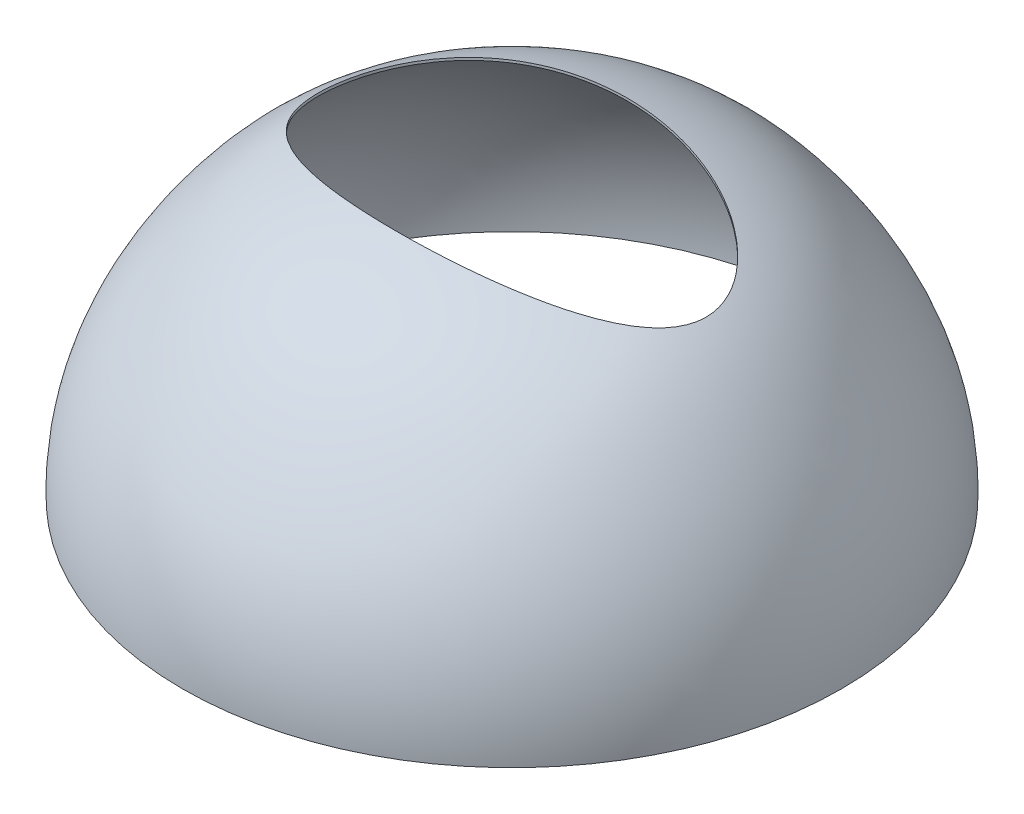
ISO-10303-21;
HEADER;
FILE_DESCRIPTION(('STEP AP214'),'2;1');
FILE_NAME('part.step','',(''),(''),'','','');
FILE_SCHEMA(('AUTOMOTIVE_DESIGN { 1 0 10303 214 1 1 1 1 }'));
ENDSEC;
DATA;
#1=APPLICATION_CONTEXT('core data for automotive mechanical design processes');
#2=APPLICATION_PROTOCOL_DEFINITION('international standard','automotive_design',2000,#1);
#3=PRODUCT_CONTEXT('',#1,'mechanical');
#4=PRODUCT('Part','Part','',(#3));
#5=PRODUCT_RELATED_PRODUCT_CATEGORY('part','',(#4));
#6=PRODUCT_DEFINITION_FORMATION('','',#4);
#7=PRODUCT_DEFINITION_CONTEXT('part definition',#1,'design');
#8=PRODUCT_DEFINITION('design','',#6,#7);
#9=PRODUCT_DEFINITION_SHAPE('','',#8);
#10=(LENGTH_UNIT() NAMED_UNIT(*) SI_UNIT(.MILLI.,.METRE.));
#11=(NAMED_UNIT(*) PLANE_ANGLE_UNIT() SI_UNIT($,.RADIAN.));
#12=(NAMED_UNIT(*) SI_UNIT($,.STERADIAN.) SOLID_ANGLE_UNIT());
#13=UNCERTAINTY_MEASURE_WITH_UNIT(LENGTH_MEASURE(1.E-05),#10,'distance_accuracy_value','');
#14=(GEOMETRIC_REPRESENTATION_CONTEXT(3) GLOBAL_UNCERTAINTY_ASSIGNED_CONTEXT((#13)) GLOBAL_UNIT_ASSIGNED_CONTEXT((#10,
#11,#12)) REPRESENTATION_CONTEXT('',''));
#15=CARTESIAN_POINT('',(0.,0.,0.));
#16=DIRECTION('',(0.,0.,1.));
#17=DIRECTION('',(1.,0.,0.));
#18=AXIS2_PLACEMENT_3D('',#15,#16,#17);
#19=CARTESIAN_POINT('',(29.8868118719822,127.,0.));
#20=CARTESIAN_POINT('',(44.4329937192612,123.661749797372,0.));
#21=CARTESIAN_POINT('',(59.4600695965972,119.177364974383,0.));
#22=CARTESIAN_POINT('',(76.3802162825854,110.552780869151,0.));
#23=CARTESIAN_POINT('',(79.6711653986904,108.677112641996,0.));
#24=CARTESIAN_POINT('',(84.422549965413,105.608187262072,0.));
#25=CARTESIAN_POINT('',(85.9755118883935,104.542641875036,0.));
#26=CARTESIAN_POINT('',(89.0122960555895,102.321504935741,0.));
#27=CARTESIAN_POINT('',(90.4951707596923,101.165037474816,0.));
#28=CARTESIAN_POINT('',(97.7393856845095,95.1560315878875,0.));
#29=CARTESIAN_POINT('',(102.992721730063,89.6397027291977,0.));
#30=CARTESIAN_POINT('',(109.009496987695,82.2474176647865,0.));
#31=CARTESIAN_POINT('',(110.185400974135,80.7441028935997,0.));
#32=CARTESIAN_POINT('',(112.485234630238,77.6979000253078,0.));
#33=CARTESIAN_POINT('',(113.608562564087,76.1554974018456,0.));
#34=CARTESIAN_POINT('',(116.89329072223,71.4725221185557,0.));
#35=CARTESIAN_POINT('',(118.969431325965,68.2761832175255,0.));
#36=CARTESIAN_POINT('',(124.813040843106,58.481166274015,0.));
#37=CARTESIAN_POINT('',(128.195628136789,51.6765538497008,0.));
#38=CARTESIAN_POINT('',(136.456109379892,30.5740358809839,0.));
#39=CARTESIAN_POINT('',(139.447346625365,15.5902478947314,0.));
#40=CARTESIAN_POINT('',(139.000412177218,0.028708614482394,0.));
#41=B_SPLINE_CURVE_WITH_KNOTS('',3,(#19,#20,#21,#22,#23,#24,#25,#26,#27,#28,#29,#30,#31,#32,#33,
#34,#35,#36,#37,#38,#39,#40),.UNSPECIFIED.,.F.,.F.,(4,2,2,2,2,2,2,2,2,2,4),(0.,0.25,0.3125,
0.34375,0.375,0.5,0.53125,0.5625,0.625,0.75,1.),.UNSPECIFIED.);
#42=CARTESIAN_POINT('',(0.,0.,0.));
#43=DIRECTION('',(0.,-1.,0.));
#44=AXIS1_PLACEMENT('',#42,#43);
#45=SURFACE_OF_REVOLUTION('',#41,#44);
#46=CARTESIAN_POINT('',(0.,0.028708614482394,0.));
#47=DIRECTION('',(0.,-1.,0.));
#48=DIRECTION('',(0.,0.,-1.));
#49=AXIS2_PLACEMENT_3D('',#46,#47,#48);
#50=CIRCLE('',#49,139.000412177218);
#51=CARTESIAN_POINT('',(0.,0.028708614482394,-139.000412177218));
#52=VERTEX_POINT('',#51);
#53=EDGE_CURVE('E10',#52,#52,#50,.T.);
#54=ORIENTED_EDGE('',*,*,#53,.T.);
#55=EDGE_LOOP('',(#54));
#56=FACE_BOUND('',#55,.T.);
#57=CARTESIAN_POINT('',(82.4558676308737,106.877258838717,0.));
#58=CARTESIAN_POINT('',(82.4558709742533,106.877256926171,-0.55983278321701));
#59=CARTESIAN_POINT('',(82.439726755892,106.883935808312,-1.11963123993114));
#60=CARTESIAN_POINT('',(82.3753457373632,106.910528810066,-2.23718602545306));
#61=CARTESIAN_POINT('',(82.3271026485585,106.930445523163,-2.79494193256119));
#62=CARTESIAN_POINT('',(82.19908225111,106.983165912625,-3.90619215535379));
#63=CARTESIAN_POINT('',(82.119304962384,107.01596958085,-4.45968647372975));
#64=CARTESIAN_POINT('',(81.9290147161722,107.093945625239,-5.5611155436365));
#65=CARTESIAN_POINT('',(81.8184671098311,107.13913194397,-6.10904330177174));
#66=CARTESIAN_POINT('',(81.5678575225396,107.241122345331,-7.19698672130256));
#67=CARTESIAN_POINT('',(81.4277960165102,107.297926241018,-7.73700250986354));
#68=CARTESIAN_POINT('',(81.1195719464501,107.422279071418,-8.8076238213624));
#69=CARTESIAN_POINT('',(80.9514103925807,107.489827619869,-9.33822968181715));
#70=CARTESIAN_POINT('',(80.5000906626474,107.670027245619,-10.6447990522715));
#71=CARTESIAN_POINT('',(80.2008096934043,107.78862374265,-11.4144204146315));
#72=CARTESIAN_POINT('',(79.5487721265541,108.044207759791,-12.9273232452892));
#73=CARTESIAN_POINT('',(79.1960142780116,108.181195710108,-13.6706040969257));
#74=CARTESIAN_POINT('',(78.4423450242155,108.47029038686,-15.1290692500658));
#75=CARTESIAN_POINT('',(78.0414393786132,108.622395304563,-15.8442568986457));
#76=CARTESIAN_POINT('',(77.1964589693395,108.938666867007,-17.2457488118315));
#77=CARTESIAN_POINT('',(76.7523858142696,109.102833062239,-17.9320541513482));
#78=CARTESIAN_POINT('',(75.8987979534368,109.413801353391,-19.169569999774));
#79=CARTESIAN_POINT('',(75.4948877756979,109.55925560951,-19.7250088497046));
#80=CARTESIAN_POINT('',(74.6621906976584,109.855258957439,-20.8154090808755));
#81=CARTESIAN_POINT('',(74.2334057777082,110.00580764327,-21.3503720866443));
#82=CARTESIAN_POINT('',(73.3533646579042,110.310616821146,-22.39993543496));
#83=CARTESIAN_POINT('',(72.9021181955127,110.46487569003,-22.9145444306422));
#84=CARTESIAN_POINT('',(71.9789654613736,110.776008437727,-23.9240839396434));
#85=CARTESIAN_POINT('',(71.5070577832718,110.932882494097,-24.41901310902));
#86=CARTESIAN_POINT('',(70.3891763885902,111.299052671097,-25.5461565024348));
#87=CARTESIAN_POINT('',(69.7361385389412,111.508942461589,-26.1711822525929));
#88=CARTESIAN_POINT('',(68.4007465786777,111.929452351897,-27.3888261878911));
#89=CARTESIAN_POINT('',(67.7183901519955,112.140072508196,-27.9814418043053));
#90=CARTESIAN_POINT('',(66.3272603111334,112.560422269747,-29.1356876379385));
#91=CARTESIAN_POINT('',(65.6184766808621,112.770151494946,-29.6973056597539));
#92=CARTESIAN_POINT('',(64.177492324988,113.187224048276,-30.7904925455193));
#93=CARTESIAN_POINT('',(63.445292090916,113.394567426365,-31.3220620395614));
#94=CARTESIAN_POINT('',(61.9615320549369,113.805239213832,-32.355129607065));
#95=CARTESIAN_POINT('',(61.2100204278062,114.008575730379,-32.8566937584652));
#96=CARTESIAN_POINT('',(59.6880994095858,114.410758557106,-33.8321332766875));
#97=CARTESIAN_POINT('',(58.9176901393975,114.609604895996,-34.3060088205874));
#98=CARTESIAN_POINT('',(57.3598634095524,115.001987722815,-35.2270204077954));
#99=CARTESIAN_POINT('',(56.5724478331405,115.195524793347,-35.6741593914005));
#100=CARTESIAN_POINT('',(54.9821090676048,115.576649385519,-36.5426801565505));
#101=CARTESIAN_POINT('',(54.1791851485351,115.764236626009,-36.9640607217926));
#102=CARTESIAN_POINT('',(52.1608731426174,116.223556188056,-37.9830392892238));
#103=CARTESIAN_POINT('',(50.9368423501216,116.491298208437,-38.5653789701781));
#104=CARTESIAN_POINT('',(48.4615913808255,117.010744887391,-39.6771061619838));
#105=CARTESIAN_POINT('',(47.2103686605108,117.262448036966,-40.2064886930832));
#106=CARTESIAN_POINT('',(44.6838571816721,117.748681886645,-41.2146205524916));
#107=CARTESIAN_POINT('',(43.4085592613096,117.983205876487,-41.6933501276184));
#108=CARTESIAN_POINT('',(40.8375137876968,118.433959139598,-42.6017943722788));
#109=CARTESIAN_POINT('',(39.5417667890259,118.650188907999,-43.0315103684706));
#110=CARTESIAN_POINT('',(36.9344018352655,119.063202552343,-43.8429640118471));
#111=CARTESIAN_POINT('',(35.6228095280644,119.260014084554,-44.2247701114645));
#112=CARTESIAN_POINT('',(32.9843413494389,119.633784480205,-44.9424942262537));
#113=CARTESIAN_POINT('',(31.6574653884462,119.810743227234,-45.2784119723531));
#114=CARTESIAN_POINT('',(28.9908690741555,120.144079793675,-45.9054558362635));
#115=CARTESIAN_POINT('',(27.6511509704657,120.300461149498,-46.1965896520537));
#116=CARTESIAN_POINT('',(24.960673416154,120.592027495391,-46.7350957085659));
#117=CARTESIAN_POINT('',(23.6099139908408,120.727212534034,-46.9824680495681));
#118=CARTESIAN_POINT('',(20.8997844643516,120.975730352337,-47.4341495043492));
#119=CARTESIAN_POINT('',(19.5404180231449,121.089071850324,-47.63847580197));
#120=CARTESIAN_POINT('',(16.8143309669603,121.293416949278,-48.0048189322492));
#121=CARTESIAN_POINT('',(15.4476103518134,121.384420549731,-48.1668357639351));
#122=CARTESIAN_POINT('',(12.7085103487928,121.543609615696,-48.4490470154029));
#123=CARTESIAN_POINT('',(11.3361308482849,121.611794624786,-48.5692405986324));
#124=CARTESIAN_POINT('',(8.5874180771661,121.724956221621,-48.7681512551814));
#125=CARTESIAN_POINT('',(7.21108480812865,121.769932818601,-48.8468683450058));
#126=CARTESIAN_POINT('',(4.45626228423913,121.836403934846,-48.9630450375206));
#127=CARTESIAN_POINT('',(3.07777327826099,121.857900989402,-49.0005090946628));
#128=CARTESIAN_POINT('',(0.320125629285076,121.877288224653,-49.0343008396193));
#129=CARTESIAN_POINT('',(-1.05903301370121,121.875178405754,-49.0306285281389));
#130=CARTESIAN_POINT('',(-3.81637565361324,121.847365260541,-48.9821374283193));
#131=CARTESIAN_POINT('',(-5.19455966002169,121.821662167029,-48.93731904598));
#132=CARTESIAN_POINT('',(-7.94833046997464,121.746821682714,-48.8064094538631));
#133=CARTESIAN_POINT('',(-9.32391727326907,121.697684289654,-48.720318240112));
#134=CARTESIAN_POINT('',(-12.070975721911,121.576261831076,-48.5066055091966));
#135=CARTESIAN_POINT('',(-13.4424469495743,121.50397449129,-48.3789799116464));
#136=CARTESIAN_POINT('',(-16.1794555962062,121.336659797918,-48.0818270475035));
#137=CARTESIAN_POINT('',(-17.5449930105575,121.241632426641,-47.9122997483117));
#138=CARTESIAN_POINT('',(-20.2684540766547,121.029329564215,-47.5308267234378));
#139=CARTESIAN_POINT('',(-21.6263774230135,120.912053187177,-47.3188793086934));
#140=CARTESIAN_POINT('',(-24.3327472399139,120.655818340999,-46.8519142535417));
#141=CARTESIAN_POINT('',(-25.6811937208322,120.516859895604,-46.5968966603022));
#142=CARTESIAN_POINT('',(-28.3673570663597,120.217801957111,-46.0428390242115));
#143=CARTESIAN_POINT('',(-29.7050683653317,120.057692165522,-45.7437775283952));
#144=CARTESIAN_POINT('',(-32.3670496787898,119.71704163488,-45.1007278553057));
#145=CARTESIAN_POINT('',(-33.6913196034116,119.536500759329,-44.7567393778797));
#146=CARTESIAN_POINT('',(-36.3241462585576,119.155700532899,-44.0226551580389));
#147=CARTESIAN_POINT('',(-37.632703249231,118.955441508988,-43.6325601801428));
#148=CARTESIAN_POINT('',(-40.2316326992316,118.535980710031,-42.8048600118887));
#149=CARTESIAN_POINT('',(-41.5220055525852,118.316779346177,-42.3672558527863));
#150=CARTESIAN_POINT('',(-43.9751346031928,117.879333563407,-41.481408456585));
#151=CARTESIAN_POINT('',(-45.1395652253292,117.662531376018,-41.0370901286434));
#152=CARTESIAN_POINT('',(-47.4484249304686,117.214534004743,-40.1056735298758));
#153=CARTESIAN_POINT('',(-48.5928538660646,116.983338714841,-39.6185749439302));
#154=CARTESIAN_POINT('',(-50.858962863807,116.507498323413,-38.5999237940714));
#155=CARTESIAN_POINT('',(-51.9806424658729,116.262852950244,-38.0683703322185));
#156=CARTESIAN_POINT('',(-54.1980357985431,115.761280560392,-36.9589334642087));
#157=CARTESIAN_POINT('',(-55.2937510834133,115.504354281656,-36.3810528403934));
#158=CARTESIAN_POINT('',(-57.2186891884492,115.037164590635,-35.3087533006942));
#159=CARTESIAN_POINT('',(-58.0537001721327,114.82901126719,-34.8237895553437));
#160=CARTESIAN_POINT('',(-59.703651047295,114.406958252699,-33.8231456426727));
#161=CARTESIAN_POINT('',(-60.5185912527903,114.193058651666,-33.307465956349));
#162=CARTESIAN_POINT('',(-62.1253990649404,113.760736318369,-32.2446184014107));
#163=CARTESIAN_POINT('',(-62.9172861037578,113.542317677666,-31.697478281687));
#164=CARTESIAN_POINT('',(-64.4760837482403,113.102034278149,-30.5699761197298));
#165=CARTESIAN_POINT('',(-65.2429952699361,112.880169646165,-29.9896152980947));
#166=CARTESIAN_POINT('',(-66.5852770712043,112.482920759634,-28.9240626392963));
#167=CARTESIAN_POINT('',(-67.1660795414442,112.307904400796,-28.4455689902304));
#168=CARTESIAN_POINT('',(-68.3087958895703,111.957597424123,-27.4666826476896));
#169=CARTESIAN_POINT('',(-68.8707112209428,111.782306828482,-26.9662916462098));
#170=CARTESIAN_POINT('',(-69.9749333055333,111.432104625673,-25.9418280228476));
#171=CARTESIAN_POINT('',(-70.5171980369138,111.257194505268,-25.4177094874447));
#172=CARTESIAN_POINT('',(-71.5788292784526,110.909293613816,-24.3459843561817));
#173=CARTESIAN_POINT('',(-72.0981914640921,110.736303209832,-23.7983733625994));
#174=CARTESIAN_POINT('',(-73.4187190316459,110.289757620368,-22.3397503316697));
#175=CARTESIAN_POINT('',(-74.1999201330291,110.018791156791,-21.409627097136));
#176=CARTESIAN_POINT('',(-75.6852640462845,109.492242398942,-19.4849620836009));
#177=CARTESIAN_POINT('',(-76.3893814117849,109.236665197324,-18.4903992036492));
#178=CARTESIAN_POINT('',(-77.7049571801738,108.749943185939,-16.4382517591234));
#179=CARTESIAN_POINT('',(-78.3166015036725,108.518749642879,-15.3807997682028));
#180=CARTESIAN_POINT('',(-79.1530985031079,108.197526441022,-13.7488009216714));
#181=CARTESIAN_POINT('',(-79.4184038071184,108.094726084164,-13.1972465461243));
#182=CARTESIAN_POINT('',(-79.9199611161365,107.898953839201,-12.0794297801357));
#183=CARTESIAN_POINT('',(-80.1562196417902,107.805979745878,-11.5131707254132));
#184=CARTESIAN_POINT('',(-80.5658507772983,107.643745842974,-10.4491653991205));
#185=CARTESIAN_POINT('',(-80.7433826473032,107.572997443042,-9.95324376773788));
#186=CARTESIAN_POINT('',(-81.074179754423,107.440540111646,-8.95221769913275));
#187=CARTESIAN_POINT('',(-81.2274477239283,107.378830162407,-8.44711430303301));
#188=CARTESIAN_POINT('',(-81.5084605867659,107.26523429937,-7.4287236419599));
#189=CARTESIAN_POINT('',(-81.6362041412675,107.213348900905,-6.91543594922013));
#190=CARTESIAN_POINT('',(-81.8647693345022,107.120219009774,-5.88302593500971));
#191=CARTESIAN_POINT('',(-81.9656448604367,107.078953223851,-5.36391750174834));
#192=CARTESIAN_POINT('',(-82.1398337222252,107.007532769296,-4.32035340042286));
#193=CARTESIAN_POINT('',(-82.2131482142097,106.977377634596,-3.79589795760329));
#194=CARTESIAN_POINT('',(-82.3314474405827,106.928651269392,-2.74346593983369));
#195=CARTESIAN_POINT('',(-82.3764442408089,106.910075105256,-2.21549096155926));
#196=CARTESIAN_POINT('',(-82.4297830999513,106.888043066945,-1.29415195098107));
#197=CARTESIAN_POINT('',(-82.4445878033393,106.881922295855,-0.901211536378856));
#198=CARTESIAN_POINT('',(-82.4582895534255,106.876257679733,-0.11508727192095));
#199=CARTESIAN_POINT('',(-82.4571902707644,106.876712317096,0.27809650082003));
#200=CARTESIAN_POINT('',(-82.439095525999,106.884192717944,1.06407584390678));
#201=CARTESIAN_POINT('',(-82.4220984049266,106.891219167208,1.45687136945595));
#202=CARTESIAN_POINT('',(-82.3723083199688,106.911780593134,2.24129379168377));
#203=CARTESIAN_POINT('',(-82.3395147571699,106.925315816572,2.63292064348627));
#204=CARTESIAN_POINT('',(-82.2443765432831,106.964524662992,3.54840625056926));
#205=CARTESIAN_POINT('',(-82.1757524076672,106.99276999502,4.0715152199385));
#206=CARTESIAN_POINT('',(-82.010995010479,107.060380265541,5.11285240977178));
#207=CARTESIAN_POINT('',(-81.914850227109,107.099749861232,5.63107849190704));
#208=CARTESIAN_POINT('',(-81.6959885859859,107.189027470809,6.66098880579867));
#209=CARTESIAN_POINT('',(-81.5732703006523,107.238936050867,7.17267268453044));
#210=CARTESIAN_POINT('',(-81.3021404614631,107.348695514497,8.18906731538126));
#211=CARTESIAN_POINT('',(-81.1536836603064,107.40856389939,8.69376406819659));
#212=CARTESIAN_POINT('',(-80.8324825025045,107.537402749204,9.6941388906404));
#213=CARTESIAN_POINT('',(-80.6597398394634,107.606372579405,10.1898175864341));
#214=CARTESIAN_POINT('',(-80.2912982946664,107.75259095544,11.1713087308278));
#215=CARTESIAN_POINT('',(-80.0955975564744,107.829840170719,11.6571203778271));
#216=CARTESIAN_POINT('',(-79.4636242921802,108.07763137498,13.1276699978487));
#217=CARTESIAN_POINT('',(-78.9922101011119,108.260276560749,14.0954878210138));
#218=CARTESIAN_POINT('',(-77.969395425609,108.649904749172,15.9826239403851));
#219=CARTESIAN_POINT('',(-77.4179640991798,108.856897130414,16.9019233483639));
#220=CARTESIAN_POINT('',(-76.2449259134227,109.288981431245,18.6923817582368));
#221=CARTESIAN_POINT('',(-75.6231929707942,109.514105654798,19.5634499556937));
#222=CARTESIAN_POINT('',(-74.3199308370145,109.976382335283,21.2559780239492));
#223=CARTESIAN_POINT('',(-73.6384016987031,110.213534781585,22.0774379385841));
#224=CARTESIAN_POINT('',(-72.2013424182426,110.702684303193,23.6972783609733));
#225=CARTESIAN_POINT('',(-71.4441562967519,110.954913665752,24.4941138915159));
#226=CARTESIAN_POINT('',(-69.8819191368526,111.462916455923,26.0388041765741));
#227=CARTESIAN_POINT('',(-69.076845106978,111.718691539934,26.7866350353857));
#228=CARTESIAN_POINT('',(-67.425233870243,112.230277638598,28.2352573153126));
#229=CARTESIAN_POINT('',(-66.5786872671663,112.486088648179,28.9360379904738));
#230=CARTESIAN_POINT('',(-64.8492226266332,112.995013864379,30.2928213877451));
#231=CARTESIAN_POINT('',(-63.9662911133184,113.248127027311,30.9488072758387));
#232=CARTESIAN_POINT('',(-62.1690437653881,113.749288324043,32.2176206502142));
#233=CARTESIAN_POINT('',(-61.2547372440099,113.997337926615,32.830460781678));
#234=CARTESIAN_POINT('',(-59.3984188972165,114.486648635333,34.0150269648375));
#235=CARTESIAN_POINT('',(-58.4564126738017,114.727911095063,34.5867612503108));
#236=CARTESIAN_POINT('',(-56.7451489447898,115.153231161972,35.5768031739188));
#237=CARTESIAN_POINT('',(-55.9804587690357,115.338799725083,36.0023863340719));
#238=CARTESIAN_POINT('',(-54.4370745446703,115.704219352965,36.8296236708935));
#239=CARTESIAN_POINT('',(-53.6583823842353,115.884071179721,37.231281042929));
#240=CARTESIAN_POINT('',(-51.304881288774,116.413923770886,38.4006773646264));
#241=CARTESIAN_POINT('',(-49.710704975177,116.754705484155,39.13395664289));
#242=CARTESIAN_POINT('',(-46.7786550724206,117.347971750639,40.3858615963512));
#243=CARTESIAN_POINT('',(-45.4478927119693,117.605131812952,40.9191073826718));
#244=CARTESIAN_POINT('',(-42.7617333651291,118.099732183488,41.9302241707569));
#245=CARTESIAN_POINT('',(-41.4063341798704,118.3371707209,42.4080902014505));
#246=CARTESIAN_POINT('',(-38.6733786565935,118.791385978955,43.3107585420458));
#247=CARTESIAN_POINT('',(-37.2958053717146,119.00814592489,43.7355178564752));
#248=CARTESIAN_POINT('',(-34.5225835519808,119.419847142701,44.5332451794927));
#249=CARTESIAN_POINT('',(-33.1269354778946,119.614788969556,44.9062145054987));
#250=CARTESIAN_POINT('',(-30.3220901354912,119.981766974304,45.6013598265874));
#251=CARTESIAN_POINT('',(-28.9129133652304,120.153833283375,45.9236027426327));
#252=CARTESIAN_POINT('',(-26.0816128568417,120.474585249808,46.5190928157822));
#253=CARTESIAN_POINT('',(-24.6594890472347,120.623270778005,46.7923397022125));
#254=CARTESIAN_POINT('',(-21.8049515438816,120.896495838606,47.2907449557813));
#255=CARTESIAN_POINT('',(-20.3725407721177,121.02104196669,47.5159164604114));
#256=CARTESIAN_POINT('',(-17.4991729007176,121.245374453434,47.9190420033815));
#257=CARTESIAN_POINT('',(-16.0582158202299,121.345160867548,48.0969961474734));
#258=CARTESIAN_POINT('',(-13.1700815863352,121.51937552362,48.40625069724));
#259=CARTESIAN_POINT('',(-11.7229057646083,121.593808944972,48.5375606321527));
#260=CARTESIAN_POINT('',(-8.8240144162158,121.716877822803,48.7540044283154));
#261=CARTESIAN_POINT('',(-7.37229888921829,121.765513277394,48.8391382861892));
#262=CARTESIAN_POINT('',(-4.46619035079544,121.836663665436,48.9635043687514));
#263=CARTESIAN_POINT('',(-3.01179720469928,121.859177247031,49.0027342178243));
#264=CARTESIAN_POINT('',(-0.102328212961678,121.877923699917,49.0354077706922));
#265=CARTESIAN_POINT('',(1.35274763250443,121.874156577954,49.02885148624));
#266=CARTESIAN_POINT('',(4.26163972479077,121.840368255772,48.9699327950483));
#267=CARTESIAN_POINT('',(5.71545599501984,121.81034755442,48.9175712586943));
#268=CARTESIAN_POINT('',(8.61993452201127,121.724258671913,48.7668779755571));
#269=CARTESIAN_POINT('',(10.0705967767541,121.668190474085,48.6685461993484));
#270=CARTESIAN_POINT('',(12.9668263025236,121.530374844339,48.425597046289));
#271=CARTESIAN_POINT('',(14.4123935535615,121.44862731179,48.2809794880542));
#272=CARTESIAN_POINT('',(17.296438514864,121.25995668629,47.9449853673595));
#273=CARTESIAN_POINT('',(18.7349162308396,121.153033613622,47.7536088425722));
#274=CARTESIAN_POINT('',(21.6031924650206,120.914580479021,47.3233820979917));
#275=CARTESIAN_POINT('',(23.0329880185851,120.783042451625,47.084516509051));
#276=CARTESIAN_POINT('',(25.8812783189812,120.496065067062,46.5585163097298));
#277=CARTESIAN_POINT('',(27.2997730019242,120.340625574869,46.2713814266649));
#278=CARTESIAN_POINT('',(30.1232127705754,120.006580560717,45.6477912642392));
#279=CARTESIAN_POINT('',(31.5281572273337,119.827973968935,45.3113337071377));
#280=CARTESIAN_POINT('',(34.3219141638489,119.448399312932,44.5878464349503));
#281=CARTESIAN_POINT('',(35.7107269320604,119.247431649237,44.2008176256616));
#282=CARTESIAN_POINT('',(38.3747326545515,118.838543375277,43.4030387089567));
#283=CARTESIAN_POINT('',(39.651178675531,118.63204797403,42.9957427672026));
#284=CARTESIAN_POINT('',(42.185228986645,118.201191403182,42.1345122583871));
#285=CARTESIAN_POINT('',(43.4428331346085,117.976830098854,41.6805773396149));
#286=CARTESIAN_POINT('',(45.9361469958879,117.511186753466,40.7244810995093));
#287=CARTESIAN_POINT('',(47.1718606590712,117.269907804757,40.2223285856264));
#288=CARTESIAN_POINT('',(49.6183949036904,116.771470291542,39.1678001947111));
#289=CARTESIAN_POINT('',(50.8292168849953,116.514312623305,38.6154271515283));
#290=CARTESIAN_POINT('',(52.9771465395518,116.039620101536,37.5767586846383));
#291=CARTESIAN_POINT('',(53.9195160027729,115.824759232921,37.1001055041633));
#292=CARTESIAN_POINT('',(55.784067054678,115.386654935664,36.1123447747884));
#293=CARTESIAN_POINT('',(56.7062488360305,115.163411587079,35.6012375549034));
#294=CARTESIAN_POINT('',(58.5279428219658,114.709551842159,34.5431890857031));
#295=CARTESIAN_POINT('',(59.4274558720824,114.478935721554,33.9962491756788));
#296=CARTESIAN_POINT('',(61.2010194375236,114.011555688682,32.8649846603495));
#297=CARTESIAN_POINT('',(62.0750713328569,113.77479211093,32.2806620867127));
#298=CARTESIAN_POINT('',(63.609049115922,113.348203518437,31.2031776059696));
#299=CARTESIAN_POINT('',(64.2745056031153,113.159266182682,30.7175287605174));
#300=CARTESIAN_POINT('',(65.5859258321093,112.779445545504,29.7213337730424));
#301=CARTESIAN_POINT('',(66.2318905417592,112.588562341334,29.210788870518));
#302=CARTESIAN_POINT('',(67.5018341807645,112.206036842775,28.1642661501238));
#303=CARTESIAN_POINT('',(68.1258293167119,112.01439522909,27.6283077946287));
#304=CARTESIAN_POINT('',(69.3499520717061,111.631485797832,26.5297296218668));
#305=CARTESIAN_POINT('',(69.9500805641187,111.440217966826,25.9671107818566));
#306=CARTESIAN_POINT('',(71.4572760629525,110.951350590772,24.4868071799924));
#307=CARTESIAN_POINT('',(72.3451299236114,110.655043980944,23.54891260601));
#308=CARTESIAN_POINT('',(74.0452115115754,110.073281519422,21.6001563753872));
#309=CARTESIAN_POINT('',(74.8573000947296,109.787846180364,20.5891662927686));
#310=CARTESIAN_POINT('',(76.2512000913069,109.28686053775,18.6820879053174));
#311=CARTESIAN_POINT('',(76.8481747799832,109.067965741205,17.7979724649092));
#312=CARTESIAN_POINT('',(77.9701493802531,108.649805904061,15.9798518119814));
#313=CARTESIAN_POINT('',(78.4951287114528,108.45054648094,15.0458324396499));
#314=CARTESIAN_POINT('',(79.2193935334951,108.171827481556,13.6104063093521));
#315=CARTESIAN_POINT('',(79.4501142480702,108.082349362883,13.1266176499375));
#316=CARTESIAN_POINT('',(79.889282964012,107.910927628301,12.1477579500892));
#317=CARTESIAN_POINT('',(80.0977342627712,107.828982897186,11.6526885931758));
#318=CARTESIAN_POINT('',(80.4908180068535,107.673566948962,10.6521176225465));
#319=CARTESIAN_POINT('',(80.6754608882461,107.600092020747,10.1466206930896));
#320=CARTESIAN_POINT('',(81.0195633051959,107.46248109954,9.12594646862192));
#321=CARTESIAN_POINT('',(81.1790260988454,107.398343898408,8.61077043567462));
#322=CARTESIAN_POINT('',(81.5095686129037,107.264844955244,7.43617730511097));
#323=CARTESIAN_POINT('',(81.6728269875447,107.198484989526,6.7741912344296));
#324=CARTESIAN_POINT('',(81.9546404282119,107.083508643621,5.43937131386008));
#325=CARTESIAN_POINT('',(82.0732045367681,107.034888674347,4.76653968699706));
#326=CARTESIAN_POINT('',(82.2636994458547,106.956594658205,3.41345737044356));
#327=CARTESIAN_POINT('',(82.335648727373,106.926913103055,2.73320972981584));
#328=CARTESIAN_POINT('',(82.4317345024195,106.887244827432,1.36862471165936));
#329=CARTESIAN_POINT('',(82.4558635442423,106.877261176433,0.684286713402759));
#330=CARTESIAN_POINT('',(82.4558676308737,106.877258838717,0.));
#331=B_SPLINE_CURVE_WITH_KNOTS('',3,(#57,#58,#59,#60,#61,#62,#63,#64,#65,#66,#67,#68,#69,#70,
#71,#72,#73,#74,#75,#76,#77,#78,#79,#80,#81,#82,#83,#84,#85,#86,#87,#88,#89,#90,#91,#92,#93,#94,
#95,#96,#97,#98,#99,#100,#101,#102,#103,#104,#105,#106,#107,#108,#109,#110,#111,#112,#113,#114,
#115,#116,#117,#118,#119,#120,#121,#122,#123,#124,#125,#126,#127,#128,#129,#130,#131,#132,#133,
#134,#135,#136,#137,#138,#139,#140,#141,#142,#143,#144,#145,#146,#147,#148,#149,#150,#151,#152,
#153,#154,#155,#156,#157,#158,#159,#160,#161,#162,#163,#164,#165,#166,#167,#168,#169,#170,#171,
#172,#173,#174,#175,#176,#177,#178,#179,#180,#181,#182,#183,#184,#185,#186,#187,#188,#189,#190,
#191,#192,#193,#194,#195,#196,#197,#198,#199,#200,#201,#202,#203,#204,#205,#206,#207,#208,#209,
#210,#211,#212,#213,#214,#215,#216,#217,#218,#219,#220,#221,#222,#223,#224,#225,#226,#227,#228,
#229,#230,#231,#232,#233,#234,#235,#236,#237,#238,#239,#240,#241,#242,#243,#244,#245,#246,#247,
#248,#249,#250,#251,#252,#253,#254,#255,#256,#257,#258,#259,#260,#261,#262,#263,#264,#265,#266,
#267,#268,#269,#270,#271,#272,#273,#274,#275,#276,#277,#278,#279,#280,#281,#282,#283,#284,#285,
#286,#287,#288,#289,#290,#291,#292,#293,#294,#295,#296,#297,#298,#299,#300,#301,#302,#303,#304,
#305,#306,#307,#308,#309,#310,#311,#312,#313,#314,#315,#316,#317,#318,#319,#320,#321,#322,#323,
#324,#325,#326,#327,#328,#329,#330),.UNSPECIFIED.,.T.,.F.,(4,2,2,2,2,2,2,2,2,2,2,2,2,2,2,2,2,2,
2,2,2,2,2,2,2,2,2,2,2,2,2,2,2,2,2,2,2,2,2,2,2,2,2,2,2,2,2,2,2,2,2,2,2,2,2,2,2,2,2,2,2,2,2,2,2,2,
2,2,2,2,2,2,2,2,2,2,2,2,2,2,2,2,2,2,2,2,2,2,2,2,2,2,2,2,2,2,2,2,2,2,2,2,2,2,2,2,2,2,2,2,2,2,2,2,
2,2,2,2,2,2,2,2,2,2,2,2,2,2,2,2,2,2,2,2,2,2,4),(0.,1.6791683270801,3.35866572465304,
5.03816206141933,6.71955729632606,8.40092547723932,10.0822332280834,12.582263904115,
15.0823530700986,17.5821434617584,20.0818407364783,22.187084437974,24.2921607643107,
26.3963323198363,28.500647324081,31.2834555826162,34.0664840791493,36.8505998117678,
39.6346571421769,42.4123387809179,45.1900026535218,47.96736049442,50.7448493799485,
54.8883527915202,59.0322454661526,63.1777482283602,67.3231387569681,71.4625373357223,
75.6019601853389,79.7406707061221,83.8793717428588,88.0164174796767,92.1534633115924,
96.2905918883073,100.427718818717,104.564398983418,108.701079077182,112.837718353597,
116.974358028271,121.111404213946,125.248453618195,129.385667782122,133.522877415267,
137.662108912149,141.801368064248,145.940558590508,150.07965928759,153.873864566808,
157.668097796494,161.462407684042,165.256489861356,168.219275644738,171.182015044518,
174.142180167829,177.102236598186,179.419559649073,181.736703956893,184.058541568559,
186.38081573468,190.110444993244,193.84130176316,197.564554791178,199.425649733894,
201.286326117744,202.880081041208,204.473656361915,206.067315248402,207.657753364119,
209.248124756679,210.837818050959,212.017265364015,213.196440464913,214.375738628594,
215.555081508246,217.139205263473,218.723993200598,220.308866296763,221.896554324033,
223.484131686818,225.071837512896,228.342284505982,231.613995432895,234.89167001168,
238.169341694123,241.550386227947,244.933067346693,248.316518437857,251.70123412113,
255.08495364453,258.467993486835,261.15133177424,263.834310885856,269.19340414493,
273.561602882469,277.930193420831,282.302298200119,286.674291742757,291.040468288498,
295.406668954019,299.771674942609,304.136671154885,308.500775101157,312.864879366517,
317.229209472181,321.593538457574,325.957784514353,330.322033364678,334.686299317769,
339.050561754675,343.416238927887,347.781940764641,352.147844274781,356.5136695966,
360.579684430945,364.645729929896,368.711034130649,372.776109076184,376.00848576828,
379.240831597537,382.473056682728,385.705106252346,388.240204853083,390.775177367627,
393.308238928543,395.841207710238,399.812486130993,403.790919929731,407.054850002686,
410.319711157479,411.949414038779,413.57887527747,415.207619820012,416.836153443658,
418.889520516402,420.942471929302,422.994608926973,425.047065678763),.UNSPECIFIED.);
#332=CARTESIAN_POINT('',(82.4558676308737,106.877258838717,0.));
#333=VERTEX_POINT('',#332);
#334=EDGE_CURVE('E49',#333,#333,#331,.T.);
#335=ORIENTED_EDGE('',*,*,#334,.T.);
#336=EDGE_LOOP('',(#335));
#337=FACE_BOUND('',#336,.T.);
#338=ADVANCED_FACE('F31',(#56,#337),#45,.F.);
#339=CARTESIAN_POINT('',(30.,128.,0.));
#340=CARTESIAN_POINT('',(50.8605555704642,123.220105799841,0.));
#341=CARTESIAN_POINT('',(83.3987409459128,112.633479794389,0.));
#342=CARTESIAN_POINT('',(125.219327377445,67.0956026553862,0.));
#343=CARTESIAN_POINT('',(140.848054586459,29.5278979136491,0.));
#344=CARTESIAN_POINT('',(140.,0.,0.));
#345=B_SPLINE_CURVE_WITH_KNOTS('',3,(#339,#340,#341,#342,#343,#344),.UNSPECIFIED.,.F.,.F.,(4,1,
1,4),(0.,0.35728447882746,0.530346239110189,1.),.UNSPECIFIED.);
#346=CARTESIAN_POINT('',(0.,0.,0.));
#347=DIRECTION('',(0.,-1.,0.));
#348=AXIS1_PLACEMENT('',#346,#347);
#349=SURFACE_OF_REVOLUTION('',#345,#348);
#350=CARTESIAN_POINT('',(0.,0.,0.));
#351=DIRECTION('',(0.,-1.,0.));
#352=DIRECTION('',(0.,0.,-1.));
#353=AXIS2_PLACEMENT_3D('',#350,#351,#352);
#354=CIRCLE('',#353,140.);
#355=CARTESIAN_POINT('',(0.,0.,-140.));
#356=VERTEX_POINT('',#355);
#357=EDGE_CURVE('E45',#356,#356,#354,.T.);
#358=ORIENTED_EDGE('',*,*,#357,.F.);
#359=EDGE_LOOP('',(#358));
#360=FACE_BOUND('',#359,.T.);
#361=CARTESIAN_POINT('',(82.4558676308737,108.061971461473,0.));
#362=CARTESIAN_POINT('',(82.4558722014156,108.061968889481,-0.560541113958243));
#363=CARTESIAN_POINT('',(82.4396865888189,108.068574639981,-1.12103780053955));
#364=CARTESIAN_POINT('',(82.3751441168901,108.094874999839,-2.23997389908811));
#365=CARTESIAN_POINT('',(82.3267821609002,108.11457168277,-2.79841297104077));
#366=CARTESIAN_POINT('',(82.1984457066545,108.166711449527,-3.91102315907524));
#367=CARTESIAN_POINT('',(82.1184715382413,108.199154400358,-4.46519431962703));
#368=CARTESIAN_POINT('',(81.9277155530016,108.276274417344,-5.56794294645831));
#369=CARTESIAN_POINT('',(81.8169009574846,108.320964499563,-6.11651381379519));
#370=CARTESIAN_POINT('',(81.5656825056795,108.421841215468,-7.20574726225903));
#371=CARTESIAN_POINT('',(81.425278864261,108.478027765669,-7.74640990078346));
#372=CARTESIAN_POINT('',(81.1162970676975,108.60103807917,-8.81832236310044));
#373=CARTESIAN_POINT('',(80.9477198603774,108.667861484618,-9.3495725028868));
#374=CARTESIAN_POINT('',(80.4952583360178,108.846148514714,-10.6577907242308));
#375=CARTESIAN_POINT('',(80.1952037538014,108.963502227203,-11.4284106530313));
#376=CARTESIAN_POINT('',(79.54146481005,109.216442229606,-12.9432750303028));
#377=CARTESIAN_POINT('',(79.1877792905198,109.352028913198,-13.6875189088359));
#378=CARTESIAN_POINT('',(78.4321131249308,109.63820637223,-15.1478665326582));
#379=CARTESIAN_POINT('',(78.0301379021792,109.788795462462,-15.8639734259832));
#380=CARTESIAN_POINT('',(77.1828970219534,110.101956708512,-17.2672419065835));
#381=CARTESIAN_POINT('',(76.7376329731775,110.26452841898,-17.9544045681248));
#382=CARTESIAN_POINT('',(75.8822490466056,110.572338492929,-19.1927220075923));
#383=CARTESIAN_POINT('',(75.477782817745,110.716227773008,-19.7481416143625));
#384=CARTESIAN_POINT('',(74.6439728686114,111.009071413083,-20.838499075446));
#385=CARTESIAN_POINT('',(74.2146311424838,111.158025366675,-21.3734385658548));
#386=CARTESIAN_POINT('',(73.3334788123645,111.459633264785,-22.4229465673264));
#387=CARTESIAN_POINT('',(72.8816779501845,111.61228559063,-22.9375237397053));
#388=CARTESIAN_POINT('',(71.9574217150871,111.920206853449,-23.94698823845));
#389=CARTESIAN_POINT('',(71.4849649364749,112.07547596806,-24.4418742203822));
#390=CARTESIAN_POINT('',(70.3657840980506,112.437945629214,-25.5689358225956));
#391=CARTESIAN_POINT('',(69.7119973629954,112.645745080139,-26.1939160252977));
#392=CARTESIAN_POINT('',(68.3751266084495,113.06211760071,-27.4114384454885));
#393=CARTESIAN_POINT('',(67.6920402736263,113.270690730299,-28.0039780909843));
#394=CARTESIAN_POINT('',(66.2994768115922,113.687010480592,-29.1580398488374));
#395=CARTESIAN_POINT('',(65.5899894730435,113.894756746359,-29.7195497464419));
#396=CARTESIAN_POINT('',(64.1476297952544,114.307940396912,-30.8124887349874));
#397=CARTESIAN_POINT('',(63.4147579465465,114.513377830007,-31.343918456267));
#398=CARTESIAN_POINT('',(61.9296950581762,114.920323173179,-32.3766749043485));
#399=CARTESIAN_POINT('',(61.1775522087782,115.121839018501,-32.8780679095256));
#400=CARTESIAN_POINT('',(59.6544064898138,115.520465813923,-33.853138499244));
#401=CARTESIAN_POINT('',(58.8834037411992,115.717576792257,-34.326816261462));
#402=CARTESIAN_POINT('',(57.3244290346949,116.106575742547,-35.2474084868813));
#403=CARTESIAN_POINT('',(56.5364589569186,116.298464287911,-35.6943258948021));
#404=CARTESIAN_POINT('',(54.9450502789688,116.67637849077,-36.562382622478));
#405=CARTESIAN_POINT('',(54.141610949402,116.862403870715,-36.9835207227764));
#406=CARTESIAN_POINT('',(52.1207101680652,117.3182434212,-38.0025547596035));
#407=CARTESIAN_POINT('',(50.894594704171,117.584103773417,-38.5851192456802));
#408=CARTESIAN_POINT('',(48.415201145155,118.099934902762,-39.6971485730965));
#409=CARTESIAN_POINT('',(47.1619205002766,118.349904179598,-40.226608403493));
#410=CARTESIAN_POINT('',(44.6313242878701,118.832806193659,-41.2347620661508));
#411=CARTESIAN_POINT('',(43.3539995441435,119.065732253693,-41.7134360342296));
#412=CARTESIAN_POINT('',(40.7789377292616,119.513414513863,-42.6216472092101));
#413=CARTESIAN_POINT('',(39.4812012139251,119.728171207744,-43.0511857514589));
#414=CARTESIAN_POINT('',(36.8699036061789,120.138353860213,-43.8621712067276));
#415=CARTESIAN_POINT('',(35.5563681650691,120.333807375037,-44.2436868949059));
#416=CARTESIAN_POINT('',(32.914053776352,120.704965143723,-44.9607260775699));
#417=CARTESIAN_POINT('',(31.5852747391212,120.880669281404,-45.296249301496));
#418=CARTESIAN_POINT('',(28.914914064267,121.211590941431,-45.9224055993427));
#419=CARTESIAN_POINT('',(27.5733346784626,121.36681199839,-46.2130464197645));
#420=CARTESIAN_POINT('',(24.8791753045535,121.65614398428,-46.7504724183207));
#421=CARTESIAN_POINT('',(23.5265953417769,121.790254961801,-46.997257697399));
#422=CARTESIAN_POINT('',(20.8128653533974,122.036704825499,-47.4476742708728));
#423=CARTESIAN_POINT('',(19.4517189647118,122.149052382173,-47.6513227539019));
#424=CARTESIAN_POINT('',(16.7221131193986,122.351484210942,-48.0162208037856));
#425=CARTESIAN_POINT('',(15.3536536625985,122.44156848251,-48.1774703696399));
#426=CARTESIAN_POINT('',(12.6111171648164,122.598990346952,-48.4580583119654));
#427=CARTESIAN_POINT('',(11.2370400108043,122.666327479841,-48.5773958409106));
#428=CARTESIAN_POINT('',(8.48497405391549,122.777863547367,-48.774505251238));
#429=CARTESIAN_POINT('',(7.10698525259491,122.822062491207,-48.852277149154));
#430=CARTESIAN_POINT('',(4.34889346051018,122.887049364284,-48.9664732013662));
#431=CARTESIAN_POINT('',(2.96879071188734,122.907839799416,-49.0029017814926));
#432=CARTESIAN_POINT('',(0.207959433668889,122.925887270413,-49.0345298521479));
#433=CARTESIAN_POINT('',(-1.17276909591878,122.923144306577,-49.0297293431997));
#434=CARTESIAN_POINT('',(-3.93320632224396,122.894142550941,-48.9788858695741));
#435=CARTESIAN_POINT('',(-5.31291502898541,122.867883992966,-48.9328433149813));
#436=CARTESIAN_POINT('',(-8.06968864893079,122.792015750856,-48.7993850052488));
#437=CARTESIAN_POINT('',(-9.44675356187935,122.742406064466,-48.711969246113));
#438=CARTESIAN_POINT('',(-12.1967224759196,122.620128495097,-48.4955010758654));
#439=CARTESIAN_POINT('',(-13.569626046114,122.547458301416,-48.3664444922485));
#440=CARTESIAN_POINT('',(-16.3094480631668,122.37947465091,-48.0663164490022));
#441=CARTESIAN_POINT('',(-17.6763665052581,122.284161176054,-47.8952449559137));
#442=CARTESIAN_POINT('',(-20.4025359957306,122.071390535043,-47.5105615048522));
#443=CARTESIAN_POINT('',(-21.7617867287918,121.953932464973,-47.2969478103372));
#444=CARTESIAN_POINT('',(-24.4707511259991,121.697447213109,-46.8265179923771));
#445=CARTESIAN_POINT('',(-25.82046480106,121.558420056004,-46.5697019183838));
#446=CARTESIAN_POINT('',(-28.5091066514838,121.259345883473,-46.0118996896521));
#447=CARTESIAN_POINT('',(-29.8480291393965,121.099288466427,-45.7108916687601));
#448=CARTESIAN_POINT('',(-32.5123568481002,120.758875508553,-45.0637888057708));
#449=CARTESIAN_POINT('',(-33.8377619755271,120.578519827629,-44.7176936524851));
#450=CARTESIAN_POINT('',(-36.4727682000807,120.198235741733,-43.9792194215647));
#451=CARTESIAN_POINT('',(-37.7823695870754,119.998307696367,-43.5868411942686));
#452=CARTESIAN_POINT('',(-40.3832830069786,119.579669346792,-42.7543772269253));
#453=CARTESIAN_POINT('',(-41.6745954499567,119.360959464483,-42.3142925584592));
#454=CARTESIAN_POINT('',(-44.1255561864265,118.925310952152,-41.4248755956152));
#455=CARTESIAN_POINT('',(-45.2869469831138,118.709849457728,-40.9796216172604));
#456=CARTESIAN_POINT('',(-47.5897409956648,118.264790476358,-40.0464128881965));
#457=CARTESIAN_POINT('',(-48.7311440697757,118.035192889211,-39.5584578347987));
#458=CARTESIAN_POINT('',(-50.9912138391876,117.56281503907,-38.5381679549921));
#459=CARTESIAN_POINT('',(-52.1098801443208,117.320034550118,-38.0058323678025));
#460=CARTESIAN_POINT('',(-54.3212629342253,116.822468103845,-36.8948977945611));
#461=CARTESIAN_POINT('',(-55.4139809783593,116.567682870711,-36.3163015977161));
#462=CARTESIAN_POINT('',(-57.3326429343173,116.104789303505,-35.2433130799801));
#463=CARTESIAN_POINT('',(-58.1643929110389,115.898742645272,-34.7583973279088));
#464=CARTESIAN_POINT('',(-59.8078740974875,115.481091993047,-33.7579549116534));
#465=CARTESIAN_POINT('',(-60.6196056213541,115.269488086371,-33.2424287282566));
#466=CARTESIAN_POINT('',(-62.2200572830483,114.8419419206,-32.179995126802));
#467=CARTESIAN_POINT('',(-63.0087967307308,114.6260035752,-31.6331152577095));
#468=CARTESIAN_POINT('',(-64.5613576751848,114.190862813926,-30.5062477048274));
#469=CARTESIAN_POINT('',(-65.325180086682,113.971660518307,-29.9262612385636));
#470=CARTESIAN_POINT('',(-66.6618841285947,113.579350337762,-28.8615850393077));
#471=CARTESIAN_POINT('',(-67.2401896771377,113.40657684026,-28.383574277354));
#472=CARTESIAN_POINT('',(-68.3779588385531,113.06084958085,-27.4057451799626));
#473=CARTESIAN_POINT('',(-68.9374239048375,112.887895833914,-26.905928533557));
#474=CARTESIAN_POINT('',(-70.0367834957284,112.542455902603,-25.8827210843221));
#475=CARTESIAN_POINT('',(-70.5766363467427,112.369971360857,-25.3592848411452));
#476=CARTESIAN_POINT('',(-71.6334985668518,112.02698822218,-24.2890360849641));
#477=CARTESIAN_POINT('',(-72.1505036063034,111.856490006124,-23.7422191796416));
#478=CARTESIAN_POINT('',(-73.4655340682743,111.416310569701,-22.285200758823));
#479=CARTESIAN_POINT('',(-74.243597411853,111.149261167994,-21.3559435357131));
#480=CARTESIAN_POINT('',(-75.7227458729056,110.630578268106,-19.4333163356209));
#481=CARTESIAN_POINT('',(-76.4238057903106,110.378949828412,-18.439925538216));
#482=CARTESIAN_POINT('',(-77.7334148927858,109.899992248091,-16.3904887778127));
#483=CARTESIAN_POINT('',(-78.342147868666,109.672615106811,-15.3345732679413));
#484=CARTESIAN_POINT('',(-79.1744480221339,109.356864888091,-13.7052270596929));
#485=CARTESIAN_POINT('',(-79.4383836938269,109.255846381343,-13.1546127487079));
#486=CARTESIAN_POINT('',(-79.9372751644701,109.063522547843,-12.0388015058242));
#487=CARTESIAN_POINT('',(-80.1722374140355,108.972215059664,-11.4736078538627));
#488=CARTESIAN_POINT('',(-80.5802896098696,108.812646992576,-10.4097717570182));
#489=CARTESIAN_POINT('',(-80.7574360997265,108.742949677761,-9.91289736928547));
#490=CARTESIAN_POINT('',(-81.0873506455599,108.612535460884,-8.90999383435127));
#491=CARTESIAN_POINT('',(-81.2401214386138,108.551817550608,-8.40396572210971));
#492=CARTESIAN_POINT('',(-81.5200299263818,108.440132841922,-7.38376426559449));
#493=CARTESIAN_POINT('',(-81.6471662889668,108.389166550276,-6.86959049951732));
#494=CARTESIAN_POINT('',(-81.8744157400092,108.297784534838,-5.83544546515559));
#495=CARTESIAN_POINT('',(-81.974582274945,108.257347949489,-5.3154878214657));
#496=CARTESIAN_POINT('',(-82.147253649986,108.187485220561,-4.27028068999614));
#497=CARTESIAN_POINT('',(-82.2197596441714,108.158058617614,-3.74503142393749));
#498=CARTESIAN_POINT('',(-82.3363514971153,108.110675403155,-2.69107298301623));
#499=CARTESIAN_POINT('',(-82.3804494403657,108.092713914532,-2.16236537610974));
#500=CARTESIAN_POINT('',(-82.4321519675639,108.071644310193,-1.23981723746329));
#501=CARTESIAN_POINT('',(-82.4462376943899,108.065899128346,-0.846385865901095));
#502=CARTESIAN_POINT('',(-82.4584626986181,108.060913140928,-0.0593156784682252));
#503=CARTESIAN_POINT('',(-82.4566056588033,108.061670833192,0.334323068491253));
#504=CARTESIAN_POINT('',(-82.436961340396,108.069682044617,1.12115770254847));
#505=CARTESIAN_POINT('',(-82.4191731803508,108.076935923207,1.51435356393651));
#506=CARTESIAN_POINT('',(-82.3677724269421,108.097874829575,2.29954249224778));
#507=CARTESIAN_POINT('',(-82.3341592304477,108.111560102469,2.69153551275462));
#508=CARTESIAN_POINT('',(-82.2369973035742,108.151059417472,3.60854192580977));
#509=CARTESIAN_POINT('',(-82.1671215029043,108.179429043879,4.13278789373861));
#510=CARTESIAN_POINT('',(-81.9997522723233,108.247177617991,5.1763302742215));
#511=CARTESIAN_POINT('',(-81.9022472417346,108.286561190029,5.69562451282543));
#512=CARTESIAN_POINT('',(-81.6805681664968,108.375758912694,6.72760293132162));
#513=CARTESIAN_POINT('',(-81.556392597641,108.425573659454,7.24028673165513));
#514=CARTESIAN_POINT('',(-81.282230349849,108.53505363681,8.25872335882242));
#515=CARTESIAN_POINT('',(-81.1321927506568,108.594738290859,8.76446034576564));
#516=CARTESIAN_POINT('',(-80.8077448476012,108.723115758648,9.76684154951626));
#517=CARTESIAN_POINT('',(-80.6333363229156,108.791807914781,10.2634864270943));
#518=CARTESIAN_POINT('',(-80.2614899578511,108.937383411897,11.2468332926802));
#519=CARTESIAN_POINT('',(-80.0640505151216,109.014267322779,11.7335345861025));
#520=CARTESIAN_POINT('',(-79.4264262333848,109.260908618513,13.2072336641351));
#521=CARTESIAN_POINT('',(-78.9509440807413,109.442657388737,14.1771748184534));
#522=CARTESIAN_POINT('',(-77.9196852653145,109.830259721473,16.068269417823));
#523=CARTESIAN_POINT('',(-77.3638738949562,110.036123696037,16.9894015378022));
#524=CARTESIAN_POINT('',(-76.1823507895847,110.465586933169,18.7824555029259));
#525=CARTESIAN_POINT('',(-75.5565698269413,110.689203695715,19.6543273034359));
#526=CARTESIAN_POINT('',(-74.2452474726142,111.148281933991,21.3481156119895));
#527=CARTESIAN_POINT('',(-73.5597167143296,111.383741299004,22.1700409647655));
#528=CARTESIAN_POINT('',(-72.3042257705985,111.805613930555,23.5778917429181));
#529=CARTESIAN_POINT('',(-71.7449682141152,111.990548809408,24.1738839394754));
#530=CARTESIAN_POINT('',(-70.5992854784552,112.362855882217,25.3383684343319));
#531=CARTESIAN_POINT('',(-70.012859706294,112.550228129307,25.9068601318401));
#532=CARTESIAN_POINT('',(-68.8163891393806,112.925639871297,27.0164682703767));
#533=CARTESIAN_POINT('',(-68.2063755043788,113.113678206654,27.557618785853));
#534=CARTESIAN_POINT('',(-66.964397240737,113.489385856041,28.6142415043457));
#535=CARTESIAN_POINT('',(-66.3324320496288,113.677055160486,29.1297130485608));
#536=CARTESIAN_POINT('',(-65.0496579871751,114.050644522861,30.1350751162392));
#537=CARTESIAN_POINT('',(-64.3988797076257,114.236566833707,30.625003897091));
#538=CARTESIAN_POINT('',(-63.079396673436,114.606038466465,31.5809855137027));
#539=CARTESIAN_POINT('',(-62.4106920835151,114.789587810159,32.0470385687352));
#540=CARTESIAN_POINT('',(-61.056847987139,115.153573861226,32.9561761428912));
#541=CARTESIAN_POINT('',(-60.3717055347856,115.334010000555,33.3992564993206));
#542=CARTESIAN_POINT('',(-58.9865242229252,115.691086769099,34.2631354132551));
#543=CARTESIAN_POINT('',(-58.2864843584641,115.867727140632,34.6839324608439));
#544=CARTESIAN_POINT('',(-56.1676613660671,116.390676670332,35.9130051986148));
#545=CARTESIAN_POINT('',(-54.7284638485194,116.730475411062,36.6891031610612));
#546=CARTESIAN_POINT('',(-51.8047640279112,117.389045341024,38.1603003748615));
#547=CARTESIAN_POINT('',(-50.3202594622472,117.707815477581,38.8553955726118));
#548=CARTESIAN_POINT('',(-47.519622893898,118.279566755099,40.0786969464772));
#549=CARTESIAN_POINT('',(-46.2083720473246,118.535570234556,40.6167121506808));
#550=CARTESIAN_POINT('',(-43.5611455977487,119.028720611843,41.6381255109731));
#551=CARTESIAN_POINT('',(-42.225167326357,119.2658654598,42.1215177321147));
#552=CARTESIAN_POINT('',(-39.531426772967,119.72026936813,43.0358454680119));
#553=CARTESIAN_POINT('',(-38.173655344846,119.937519808431,43.466758270327));
#554=CARTESIAN_POINT('',(-35.4398964649236,120.351071144971,44.2776073879174));
#555=CARTESIAN_POINT('',(-34.0639095718661,120.547372682134,44.6575452628427));
#556=CARTESIAN_POINT('',(-31.2980211239357,120.917962299036,45.3674900020016));
#557=CARTESIAN_POINT('',(-29.9081385870494,121.092276935637,45.6975571997731));
#558=CARTESIAN_POINT('',(-27.1151985140989,121.418397768707,46.3095336089961));
#559=CARTESIAN_POINT('',(-25.7121408865611,121.570203808777,46.5914424858276));
#560=CARTESIAN_POINT('',(-22.8953265520627,121.850559107736,47.1080529167709));
#561=CARTESIAN_POINT('',(-21.4815717948182,121.979112503233,47.3427628683268));
#562=CARTESIAN_POINT('',(-18.6451976795399,122.212331239595,47.7658399833124));
#563=CARTESIAN_POINT('',(-17.2225783444056,122.316996642144,47.9542072664063));
#564=CARTESIAN_POINT('',(-14.3708243701296,122.50182591879,48.285179818859));
#565=CARTESIAN_POINT('',(-12.9416915243109,122.581996166907,48.4277969935892));
#566=CARTESIAN_POINT('',(-10.0784576413021,122.717383201027,48.667794715132));
#567=CARTESIAN_POINT('',(-8.64435660341854,122.772599983546,48.7651752556312));
#568=CARTESIAN_POINT('',(-5.77302173409432,122.857722543858,48.91500793803));
#569=CARTESIAN_POINT('',(-4.33578781665231,122.887627617813,48.9674588305802));
#570=CARTESIAN_POINT('',(-1.46008075455822,122.921921515348,49.0275901414187));
#571=CARTESIAN_POINT('',(-0.0216076102742256,122.926310346505,49.0352705730006));
#572=CARTESIAN_POINT('',(2.85469872339543,122.909541714803,49.0058849992127));
#573=CARTESIAN_POINT('',(4.29253192720426,122.888384860259,48.968820059356));
#574=CARTESIAN_POINT('',(7.16574421992399,122.820670499456,48.8498310159752));
#575=CARTESIAN_POINT('',(8.60112330772106,122.774112981672,48.7679068920967));
#576=CARTESIAN_POINT('',(11.4675588936678,122.655905040065,48.5589435600545));
#577=CARTESIAN_POINT('',(12.8986153978241,122.584254651128,48.4319044146121));
#578=CARTESIAN_POINT('',(15.7545082438556,122.416308387811,48.1323060980076));
#579=CARTESIAN_POINT('',(17.1793445880462,122.320012522606,47.9597469437914));
#580=CARTESIAN_POINT('',(20.0212141359608,122.103305084766,47.5684928208959));
#581=CARTESIAN_POINT('',(21.4382452052459,121.982887222358,47.3497858184401));
#582=CARTESIAN_POINT('',(24.2620937969633,121.718592122444,46.8655231737509));
#583=CARTESIAN_POINT('',(25.6689112814031,121.574714797719,46.5999673573417));
#584=CARTESIAN_POINT('',(28.4702617802457,121.264193435455,46.0210584286166));
#585=CARTESIAN_POINT('',(29.8647939291784,121.097547807386,45.7077019769043));
#586=CARTESIAN_POINT('',(32.639133624696,120.742254996212,45.032068748998));
#587=CARTESIAN_POINT('',(34.0189413333781,120.553608055587,44.6697925119487));
#588=CARTESIAN_POINT('',(36.7097045499145,120.162624449599,43.9095215560835));
#589=CARTESIAN_POINT('',(38.0212976970883,119.961069607679,43.5133829008361));
#590=CARTESIAN_POINT('',(40.625987257986,119.539136502531,42.6730676848425));
#591=CARTESIAN_POINT('',(41.9190834520505,119.318758015979,42.2288905541538));
#592=CARTESIAN_POINT('',(44.4836979891904,118.860131178476,41.2908890435597));
#593=CARTESIAN_POINT('',(45.7552199247346,118.62188583918,40.7970730260813));
#594=CARTESIAN_POINT('',(48.2736355398162,118.128572050502,39.7577783564897));
#595=CARTESIAN_POINT('',(49.5205306249906,117.873504564912,39.2123026633362));
#596=CARTESIAN_POINT('',(51.7344154506446,117.401496212219,38.1842243609137));
#597=CARTESIAN_POINT('',(52.7066070025532,117.187394735447,37.711501806059));
#598=CARTESIAN_POINT('',(54.6308828218754,116.750178462824,36.7305629366917));
#599=CARTESIAN_POINT('',(55.5829672810102,116.527063752974,36.2223469608076));
#600=CARTESIAN_POINT('',(57.4645133862418,116.072818962212,35.1689983529984));
#601=CARTESIAN_POINT('',(58.393975872006,115.841689179574,34.6238670941194));
#602=CARTESIAN_POINT('',(60.227447058792,115.372624644606,33.4950821142372));
#603=CARTESIAN_POINT('',(61.1314571298092,115.134690259935,32.9114304722994));
#604=CARTESIAN_POINT('',(62.7197113831745,114.70517983742,31.8334848179156));
#605=CARTESIAN_POINT('',(63.4094724124921,114.514617035839,31.3469055291754));
#606=CARTESIAN_POINT('',(64.7694005474917,114.131117195335,30.3479985346613));
#607=CARTESIAN_POINT('',(65.4395686224974,113.938180274541,29.8356721060984));
#608=CARTESIAN_POINT('',(66.7577370365053,113.551123340164,28.7846994383255));
#609=CARTESIAN_POINT('',(67.4057538788713,113.357004340174,28.2460735531592));
#610=CARTESIAN_POINT('',(68.6777577239695,112.968685664925,27.1411654969184));
#611=CARTESIAN_POINT('',(69.3017456139039,112.774485992913,26.574884348692));
#612=CARTESIAN_POINT('',(70.390342472708,112.429509531359,25.539775318447));
#613=CARTESIAN_POINT('',(70.8601351664233,112.278461440228,25.0764903533061));
#614=CARTESIAN_POINT('',(71.7818253085762,111.978054917115,24.1319209846506));
#615=CARTESIAN_POINT('',(72.2337217318018,111.828696582283,23.6506355530171));
#616=CARTESIAN_POINT('',(73.5617650665298,111.383970677797,22.1772922390332));
#617=CARTESIAN_POINT('',(74.408714618232,111.092446306992,21.1572095824253));
#618=CARTESIAN_POINT('',(75.8629168794897,110.580211448561,19.2334185020187));
#619=CARTESIAN_POINT('',(76.4857419591237,110.356268308613,18.3423121159468));
#620=CARTESIAN_POINT('',(77.6586767056949,109.927355413048,16.5081275174045));
#621=CARTESIAN_POINT('',(78.2087657182933,109.722391051629,15.5650346499647));
#622=CARTESIAN_POINT('',(78.9697526445313,109.434746568945,14.1142411050952));
#623=CARTESIAN_POINT('',(79.2125535360036,109.342232182438,13.6250273146439));
#624=CARTESIAN_POINT('',(79.6754989702388,109.164645485069,12.6347042466202));
#625=CARTESIAN_POINT('',(79.8956468987537,109.079572062353,12.1335967605192));
#626=CARTESIAN_POINT('',(80.3116548094789,108.917842016725,11.120304610788));
#627=CARTESIAN_POINT('',(80.507525107431,108.84118182057,10.6081247612839));
#628=CARTESIAN_POINT('',(80.8735178534608,108.697187566592,9.57343010237763));
#629=CARTESIAN_POINT('',(81.0436435165235,108.629852344358,9.0509165926707));
#630=CARTESIAN_POINT('',(81.4044630263367,108.486412132156,7.83565616240519));
#631=CARTESIAN_POINT('',(81.5855965907939,108.413899187653,7.13960850485946));
#632=CARTESIAN_POINT('',(81.898487543185,108.288127723222,5.73490458169416));
#633=CARTESIAN_POINT('',(82.0302544535628,108.234865490051,5.02625077535564));
#634=CARTESIAN_POINT('',(82.242040956999,108.149044868323,3.60035965315848));
#635=CARTESIAN_POINT('',(82.3220880116996,108.116475492652,2.88312709874984));
#636=CARTESIAN_POINT('',(82.4290017919953,108.072939069806,1.44390552889761));
#637=CARTESIAN_POINT('',(82.4558617445134,108.061974773917,0.721915919414097));
#638=CARTESIAN_POINT('',(82.4558676308737,108.061971461473,0.));
#639=B_SPLINE_CURVE_WITH_KNOTS('',3,(#361,#362,#363,#364,#365,#366,#367,#368,#369,#370,#371,
#372,#373,#374,#375,#376,#377,#378,#379,#380,#381,#382,#383,#384,#385,#386,#387,#388,#389,#390,
#391,#392,#393,#394,#395,#396,#397,#398,#399,#400,#401,#402,#403,#404,#405,#406,#407,#408,#409,
#410,#411,#412,#413,#414,#415,#416,#417,#418,#419,#420,#421,#422,#423,#424,#425,#426,#427,#428,
#429,#430,#431,#432,#433,#434,#435,#436,#437,#438,#439,#440,#441,#442,#443,#444,#445,#446,#447,
#448,#449,#450,#451,#452,#453,#454,#455,#456,#457,#458,#459,#460,#461,#462,#463,#464,#465,#466,
#467,#468,#469,#470,#471,#472,#473,#474,#475,#476,#477,#478,#479,#480,#481,#482,#483,#484,#485,
#486,#487,#488,#489,#490,#491,#492,#493,#494,#495,#496,#497,#498,#499,#500,#501,#502,#503,#504,
#505,#506,#507,#508,#509,#510,#511,#512,#513,#514,#515,#516,#517,#518,#519,#520,#521,#522,#523,
#524,#525,#526,#527,#528,#529,#530,#531,#532,#533,#534,#535,#536,#537,#538,#539,#540,#541,#542,
#543,#544,#545,#546,#547,#548,#549,#550,#551,#552,#553,#554,#555,#556,#557,#558,#559,#560,#561,
#562,#563,#564,#565,#566,#567,#568,#569,#570,#571,#572,#573,#574,#575,#576,#577,#578,#579,#580,
#581,#582,#583,#584,#585,#586,#587,#588,#589,#590,#591,#592,#593,#594,#595,#596,#597,#598,#599,
#600,#601,#602,#603,#604,#605,#606,#607,#608,#609,#610,#611,#612,#613,#614,#615,#616,#617,#618,
#619,#620,#621,#622,#623,#624,#625,#626,#627,#628,#629,#630,#631,#632,#633,#634,#635,#636,#637,
#638),.UNSPECIFIED.,.T.,.F.,(4,2,2,2,2,2,2,2,2,2,2,2,2,2,2,2,2,2,2,2,2,2,2,2,2,2,2,2,2,2,2,2,2,
2,2,2,2,2,2,2,2,2,2,2,2,2,2,2,2,2,2,2,2,2,2,2,2,2,2,2,2,2,2,2,2,2,2,2,2,2,2,2,2,2,2,2,2,2,2,2,2,
2,2,2,2,2,2,2,2,2,2,2,2,2,2,2,2,2,2,2,2,2,2,2,2,2,2,2,2,2,2,2,2,2,2,2,2,2,2,2,2,2,2,2,2,2,2,2,2,
2,2,2,2,2,2,2,2,2,4),(0.,1.68127585342555,3.36281808045546,5.04434276269816,6.72766152087103,
8.41096805554791,10.0942179712333,12.5973141976412,15.1004644784149,17.6033338984,
20.1061103423301,22.211301700532,24.3163245288543,26.4204421228046,28.5247031316084,
31.3075893659397,34.090695917971,36.8748903383848,39.6590263936101,42.4367737566899,
45.214503310263,47.991926637567,50.7694812459232,54.917718618106,59.0663470495005,
63.2165922229601,67.3667245789237,71.5108440799112,75.6549879584417,79.7984157750003,
83.9418340543452,88.0835981951999,92.2253624337737,96.3672104203764,100.509056759447,
104.650459669202,108.791862526419,112.933224204626,117.07458628284,121.216363463865,
125.358143943249,129.500093521783,133.642038359251,137.78603957961,141.930069403111,
146.074023102029,150.217883738823,154.004001233724,157.790145568873,161.576354820287,
165.36233596038,168.315459791703,171.26853725161,174.219058609672,177.169471529386,
179.478752155252,181.787854226193,184.101605688219,186.415793740612,190.135037441949,
193.855494695644,197.568445763549,199.424403978022,201.279948234802,202.875566018572,
204.471004508703,206.066525886667,207.658861729255,209.251131127573,210.842722742857,
212.023545632079,213.20409575827,214.384711207138,215.565371655801,217.153381291823,
218.742058675526,220.33082687544,221.922759729727,223.514576427021,225.106503939325,
228.387410756077,231.669739404764,234.955344803059,238.240366666407,240.753356289077,
243.266400787134,245.776231929546,248.286127429273,250.792148786194,253.298147123907,
255.804597977291,258.311218450947,263.318148379302,268.325328760847,272.64473285656,
276.964605817827,281.286341772217,285.60794546682,289.924278286106,294.240641095493,
298.5562352741,302.871818309021,307.186277403944,311.500737101006,315.815316765463,
320.129895148801,324.444370791918,328.758848392691,333.073319995287,337.387789991734,
341.703386447495,346.018998948226,350.334913079817,354.650779649629,358.804309524966,
362.9578886844,367.110769279102,371.263412149064,374.568769034063,377.874094388264,
381.179296869934,384.48432110515,387.079843785929,389.675237840207,392.268654121014,
394.861974555155,396.892113490034,398.922368556428,402.989427106552,406.316393799754,
409.644303208167,411.305575972189,412.966600077667,414.626915964635,416.28702434027,
418.453618139312,420.619793803818,422.784818348854,424.95011857981),.UNSPECIFIED.);
#640=CARTESIAN_POINT('',(82.4558676308737,108.061971461473,0.));
#641=VERTEX_POINT('',#640);
#642=EDGE_CURVE('E36',#641,#641,#639,.T.);
#643=ORIENTED_EDGE('',*,*,#642,.F.);
#644=EDGE_LOOP('',(#643));
#645=FACE_BOUND('',#644,.T.);
#646=ADVANCED_FACE('F62',(#360,#645),#349,.T.);
#647=CARTESIAN_POINT('',(0.,0.,0.));
#648=DIRECTION('',(0.,-1.,0.));
#649=DIRECTION('',(0.,0.,-1.));
#650=AXIS2_PLACEMENT_3D('',#647,#648,#649);
#651=CONICAL_SURFACE('',#650,140.,1.54208376731644);
#652=ORIENTED_EDGE('',*,*,#53,.F.);
#653=EDGE_LOOP('',(#652));
#654=FACE_BOUND('',#653,.T.);
#655=ORIENTED_EDGE('',*,*,#357,.T.);
#656=EDGE_LOOP('',(#655));
#657=FACE_BOUND('',#656,.T.);
#658=ADVANCED_FACE('F65',(#654,#657),#651,.F.);
#659=CARTESIAN_POINT('',(0.,202.,0.));
#660=DIRECTION('',(0.,1.,0.));
#661=DIRECTION('',(-1.,0.,0.));
#662=AXIS2_PLACEMENT_3D('',#659,#660,#661);
#663=ELLIPSE('',#662,82.4558676308737,49.0278131859254);
#664=DIRECTION('',(0.,-1.,0.));
#665=VECTOR('',#664,1.);
#666=SURFACE_OF_LINEAR_EXTRUSION('',#663,#665);
#667=ORIENTED_EDGE('',*,*,#334,.F.);
#668=EDGE_LOOP('',(#667));
#669=FACE_BOUND('',#668,.T.);
#670=ORIENTED_EDGE('',*,*,#642,.T.);
#671=EDGE_LOOP('',(#670));
#672=FACE_BOUND('',#671,.T.);
#673=ADVANCED_FACE('F67',(#669,#672),#666,.T.);
#674=CLOSED_SHELL('',(#338,#646,#658,#673));
#675=MANIFOLD_SOLID_BREP('B2',#674);
#676=ADVANCED_BREP_SHAPE_REPRESENTATION('',(#18,#675),#14);
#677=SHAPE_DEFINITION_REPRESENTATION(#9,#676);
ENDSEC;
END-ISO-10303-21;
